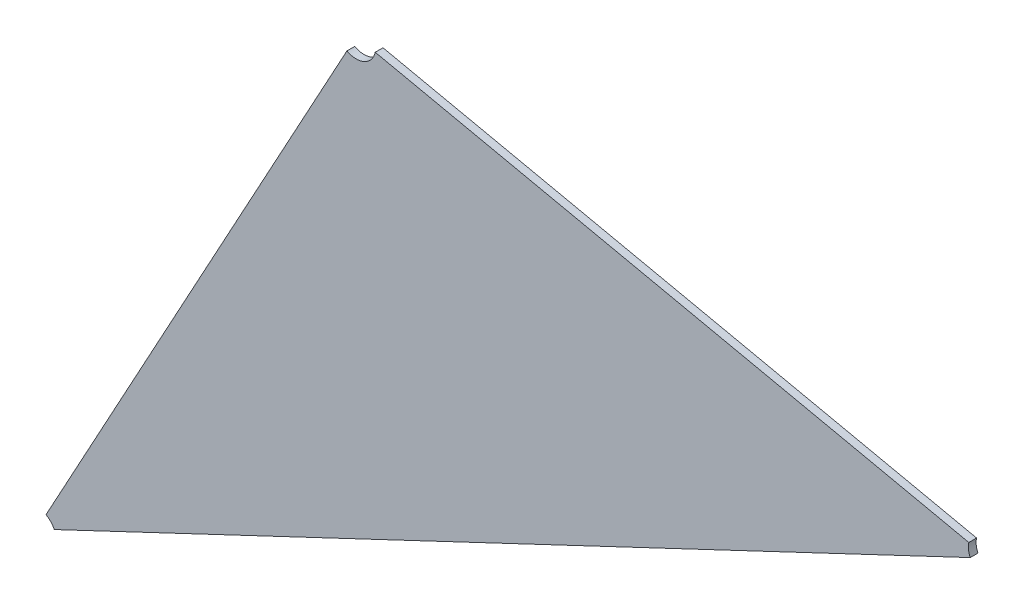
ISO-10303-21;
HEADER;
FILE_DESCRIPTION(('STEP AP214'),'2;1');
FILE_NAME('part.step','',(''),(''),'','','');
FILE_SCHEMA(('AUTOMOTIVE_DESIGN { 1 0 10303 214 1 1 1 1 }'));
ENDSEC;
DATA;
#1=APPLICATION_CONTEXT('core data for automotive mechanical design processes');
#2=APPLICATION_PROTOCOL_DEFINITION('international standard','automotive_design',2000,#1);
#3=PRODUCT_CONTEXT('',#1,'mechanical');
#4=PRODUCT('Part','Part','',(#3));
#5=PRODUCT_RELATED_PRODUCT_CATEGORY('part','',(#4));
#6=PRODUCT_DEFINITION_FORMATION('','',#4);
#7=PRODUCT_DEFINITION_CONTEXT('part definition',#1,'design');
#8=PRODUCT_DEFINITION('design','',#6,#7);
#9=PRODUCT_DEFINITION_SHAPE('','',#8);
#10=(LENGTH_UNIT() NAMED_UNIT(*) SI_UNIT(.MILLI.,.METRE.));
#11=(NAMED_UNIT(*) PLANE_ANGLE_UNIT() SI_UNIT($,.RADIAN.));
#12=(NAMED_UNIT(*) SI_UNIT($,.STERADIAN.) SOLID_ANGLE_UNIT());
#13=UNCERTAINTY_MEASURE_WITH_UNIT(LENGTH_MEASURE(1.E-05),#10,'distance_accuracy_value','');
#14=(GEOMETRIC_REPRESENTATION_CONTEXT(3) GLOBAL_UNCERTAINTY_ASSIGNED_CONTEXT((#13)) GLOBAL_UNIT_ASSIGNED_CONTEXT((#10,
#11,#12)) REPRESENTATION_CONTEXT('',''));
#15=CARTESIAN_POINT('',(0.,0.,0.));
#16=DIRECTION('',(0.,0.,1.));
#17=DIRECTION('',(1.,0.,0.));
#18=AXIS2_PLACEMENT_3D('',#15,#16,#17);
#19=CARTESIAN_POINT('',(-1.7016489577392,-1.2265091946304,0.002));
#20=DIRECTION('',(0.,0.,1.));
#21=DIRECTION('',(-1.,0.,0.));
#22=AXIS2_PLACEMENT_3D('',#19,#20,#21);
#23=CYLINDRICAL_SURFACE('',#22,0.00499999999999999);
#24=DIRECTION('',(0.,0.,-1.));
#25=VECTOR('',#24,1.);
#26=CARTESIAN_POINT('',(-1.70404189971311,-1.23089939151773,0.002));
#27=LINE('',#26,#25);
#28=CARTESIAN_POINT('',(-1.70404189971311,-1.23089939151773,0.002));
#29=VERTEX_POINT('',#28);
#30=CARTESIAN_POINT('',(-1.70404189971311,-1.23089939151773,0.));
#31=VERTEX_POINT('',#30);
#32=EDGE_CURVE('E11',#29,#31,#27,.T.);
#33=ORIENTED_EDGE('',*,*,#32,.F.);
#34=CARTESIAN_POINT('',(-1.7016489577392,-1.2265091946304,0.002));
#35=DIRECTION('',(0.,0.,-1.));
#36=DIRECTION('',(0.977619939969186,-0.210378832049818,0.));
#37=AXIS2_PLACEMENT_3D('',#34,#35,#36);
#38=CIRCLE('',#37,0.00499999999999999);
#39=CARTESIAN_POINT('',(-1.69676085803935,-1.22756108879065,0.002));
#40=VERTEX_POINT('',#39);
#41=EDGE_CURVE('E72',#40,#29,#38,.T.);
#42=ORIENTED_EDGE('',*,*,#41,.F.);
#43=DIRECTION('',(-1.11022302462516E-13,0.,1.));
#44=VECTOR('',#43,1.);
#45=CARTESIAN_POINT('',(-1.69676085803935,-1.22756108879065,0.));
#46=LINE('',#45,#44);
#47=CARTESIAN_POINT('',(-1.69676085803935,-1.22756108879065,0.));
#48=VERTEX_POINT('',#47);
#49=EDGE_CURVE('E94',#48,#40,#46,.T.);
#50=ORIENTED_EDGE('',*,*,#49,.F.);
#51=CARTESIAN_POINT('',(-1.7016489577392,-1.2265091946304,0.));
#52=DIRECTION('',(0.,0.,1.));
#53=DIRECTION('',(-0.478588394781764,-0.878039377465621,0.));
#54=AXIS2_PLACEMENT_3D('',#51,#52,#53);
#55=CIRCLE('',#54,0.00499999999999999);
#56=EDGE_CURVE('E109',#31,#48,#55,.T.);
#57=ORIENTED_EDGE('',*,*,#56,.F.);
#58=EDGE_LOOP('',(#33,#42,#50,#57));
#59=FACE_BOUND('',#58,.T.);
#60=ADVANCED_FACE('F17',(#59),#23,.F.);
#61=CARTESIAN_POINT('',(-1.53897591651193,-1.26151560460655,0.002));
#62=DIRECTION('',(0.,0.,1.));
#63=DIRECTION('',(-1.,0.,0.));
#64=AXIS2_PLACEMENT_3D('',#61,#62,#63);
#65=CYLINDRICAL_SURFACE('',#64,0.00500000000000008);
#66=DIRECTION('',(0.,0.,-1.));
#67=VECTOR('',#66,1.);
#68=CARTESIAN_POINT('',(-1.54386401621178,-1.2604637104463,0.002));
#69=LINE('',#68,#67);
#70=CARTESIAN_POINT('',(-1.54386401621178,-1.2604637104463,0.002));
#71=VERTEX_POINT('',#70);
#72=CARTESIAN_POINT('',(-1.54386401621178,-1.2604637104463,0.));
#73=VERTEX_POINT('',#72);
#74=EDGE_CURVE('E24',#71,#73,#69,.T.);
#75=ORIENTED_EDGE('',*,*,#74,.F.);
#76=CARTESIAN_POINT('',(-1.53897591651193,-1.26151560460655,0.002));
#77=DIRECTION('',(0.,0.,-1.));
#78=DIRECTION('',(-0.903806397976228,-0.427941578930159,0.));
#79=AXIS2_PLACEMENT_3D('',#76,#77,#78);
#80=CIRCLE('',#79,0.00500000000000008);
#81=CARTESIAN_POINT('',(-1.54349494850181,-1.2636553125012,0.002));
#82=VERTEX_POINT('',#81);
#83=EDGE_CURVE('E90',#82,#71,#80,.T.);
#84=ORIENTED_EDGE('',*,*,#83,.F.);
#85=DIRECTION('',(0.,0.,1.));
#86=VECTOR('',#85,1.);
#87=CARTESIAN_POINT('',(-1.54349494850181,-1.2636553125012,0.));
#88=LINE('',#87,#86);
#89=CARTESIAN_POINT('',(-1.54349494850181,-1.2636553125012,0.));
#90=VERTEX_POINT('',#89);
#91=EDGE_CURVE('E120',#90,#82,#88,.T.);
#92=ORIENTED_EDGE('',*,*,#91,.F.);
#93=CARTESIAN_POINT('',(-1.53897591651193,-1.26151560460655,0.));
#94=DIRECTION('',(0.,0.,1.));
#95=DIRECTION('',(-0.977619939969195,0.210378832049775,0.));
#96=AXIS2_PLACEMENT_3D('',#93,#94,#95);
#97=CIRCLE('',#96,0.00500000000000008);
#98=EDGE_CURVE('E75',#73,#90,#97,.T.);
#99=ORIENTED_EDGE('',*,*,#98,.F.);
#100=EDGE_LOOP('',(#75,#84,#92,#99));
#101=FACE_BOUND('',#100,.T.);
#102=ADVANCED_FACE('F124',(#101),#65,.F.);
#103=CARTESIAN_POINT('',(-1.78395411602342,-1.37750986813174,0.002));
#104=DIRECTION('',(0.,0.,1.));
#105=DIRECTION('',(-1.,0.,0.));
#106=AXIS2_PLACEMENT_3D('',#103,#104,#105);
#107=CYLINDRICAL_SURFACE('',#106,0.00499999999999997);
#108=DIRECTION('',(0.,0.,1.));
#109=VECTOR('',#108,1.);
#110=CARTESIAN_POINT('',(-1.78156117404951,-1.37311967124442,0.));
#111=LINE('',#110,#109);
#112=CARTESIAN_POINT('',(-1.78156117404951,-1.37311967124442,0.));
#113=VERTEX_POINT('',#112);
#114=CARTESIAN_POINT('',(-1.78156117404951,-1.37311967124442,0.002));
#115=VERTEX_POINT('',#114);
#116=EDGE_CURVE('E79',#113,#115,#111,.T.);
#117=ORIENTED_EDGE('',*,*,#116,.F.);
#118=CARTESIAN_POINT('',(-1.78395411602342,-1.37750986813174,0.));
#119=DIRECTION('',(0.,0.,1.));
#120=DIRECTION('',(0.903806397976253,0.427941578930105,0.));
#121=AXIS2_PLACEMENT_3D('',#118,#119,#120);
#122=CIRCLE('',#121,0.00499999999999997);
#123=CARTESIAN_POINT('',(-1.77943508403354,-1.37537016023709,0.));
#124=VERTEX_POINT('',#123);
#125=EDGE_CURVE('E123',#124,#113,#122,.T.);
#126=ORIENTED_EDGE('',*,*,#125,.F.);
#127=DIRECTION('',(0.,0.,-1.));
#128=VECTOR('',#127,1.);
#129=CARTESIAN_POINT('',(-1.77943508403354,-1.37537016023709,0.002));
#130=LINE('',#129,#128);
#131=CARTESIAN_POINT('',(-1.77943508403354,-1.37537016023709,0.002));
#132=VERTEX_POINT('',#131);
#133=EDGE_CURVE('E82',#132,#124,#130,.T.);
#134=ORIENTED_EDGE('',*,*,#133,.F.);
#135=CARTESIAN_POINT('',(-1.78395411602342,-1.37750986813174,0.002));
#136=DIRECTION('',(0.,0.,-1.));
#137=DIRECTION('',(0.478588394782654,0.878039377465135,0.));
#138=AXIS2_PLACEMENT_3D('',#135,#136,#137);
#139=CIRCLE('',#138,0.00499999999999997);
#140=EDGE_CURVE('E70',#115,#132,#139,.T.);
#141=ORIENTED_EDGE('',*,*,#140,.F.);
#142=EDGE_LOOP('',(#117,#126,#134,#141));
#143=FACE_BOUND('',#142,.T.);
#144=ADVANCED_FACE('F78',(#143),#107,.F.);
#145=CARTESIAN_POINT('',(-1.7016489577392,-1.2265091946304,0.));
#146=DIRECTION('',(-0.210378832050013,-0.977619939969144,0.));
#147=DIRECTION('',(0.977619939969144,-0.210378832050013,0.));
#148=AXIS2_PLACEMENT_3D('',#145,#146,#147);
#149=PLANE('',#148);
#150=ORIENTED_EDGE('',*,*,#49,.T.);
#151=DIRECTION('',(0.977619939969144,-0.210378832050012,0.));
#152=VECTOR('',#151,1.);
#153=CARTESIAN_POINT('',(-1.69676085803935,-1.22756108879065,0.002));
#154=LINE('',#153,#152);
#155=EDGE_CURVE('E104',#40,#71,#154,.T.);
#156=ORIENTED_EDGE('',*,*,#155,.T.);
#157=ORIENTED_EDGE('',*,*,#74,.T.);
#158=DIRECTION('',(0.977619939969144,-0.210378832050012,0.));
#159=VECTOR('',#158,1.);
#160=CARTESIAN_POINT('',(-1.69676085803935,-1.22756108879065,0.));
#161=LINE('',#160,#159);
#162=EDGE_CURVE('E102',#48,#73,#161,.T.);
#163=ORIENTED_EDGE('',*,*,#162,.F.);
#164=EDGE_LOOP('',(#150,#156,#157,#163));
#165=FACE_BOUND('',#164,.T.);
#166=ADVANCED_FACE('F101',(#165),#149,.F.);
#167=CARTESIAN_POINT('',(-1.67318128292145,-1.29395884484365,0.002));
#168=DIRECTION('',(0.,0.,-1.));
#169=DIRECTION('',(-1.,0.,0.));
#170=AXIS2_PLACEMENT_3D('',#167,#168,#169);
#171=PLANE('',#170);
#172=ORIENTED_EDGE('',*,*,#41,.T.);
#173=DIRECTION('',(0.478588394782362,0.878039377465294,0.));
#174=VECTOR('',#173,1.);
#175=CARTESIAN_POINT('',(-1.78156117404951,-1.37311967124442,0.002));
#176=LINE('',#175,#174);
#177=EDGE_CURVE('E66',#115,#29,#176,.T.);
#178=ORIENTED_EDGE('',*,*,#177,.F.);
#179=ORIENTED_EDGE('',*,*,#140,.T.);
#180=DIRECTION('',(-0.903806397975917,-0.427941578930814,0.));
#181=VECTOR('',#180,1.);
#182=CARTESIAN_POINT('',(-1.54349494850181,-1.2636553125012,0.002));
#183=LINE('',#182,#181);
#184=EDGE_CURVE('E84',#82,#132,#183,.T.);
#185=ORIENTED_EDGE('',*,*,#184,.F.);
#186=ORIENTED_EDGE('',*,*,#83,.T.);
#187=ORIENTED_EDGE('',*,*,#155,.F.);
#188=EDGE_LOOP('',(#172,#178,#179,#185,#186,#187));
#189=FACE_BOUND('',#188,.T.);
#190=ADVANCED_FACE('F68',(#189),#171,.F.);
#191=CARTESIAN_POINT('',(-1.53897591651193,-1.26151560460655,0.));
#192=DIRECTION('',(-0.427941578930813,0.903806397975918,0.));
#193=DIRECTION('',(-0.903806397975918,-0.427941578930813,0.));
#194=AXIS2_PLACEMENT_3D('',#191,#192,#193);
#195=PLANE('',#194);
#196=ORIENTED_EDGE('',*,*,#91,.T.);
#197=ORIENTED_EDGE('',*,*,#184,.T.);
#198=ORIENTED_EDGE('',*,*,#133,.T.);
#199=DIRECTION('',(-0.903806397975917,-0.427941578930814,0.));
#200=VECTOR('',#199,1.);
#201=CARTESIAN_POINT('',(-1.54349494850181,-1.2636553125012,0.));
#202=LINE('',#201,#200);
#203=EDGE_CURVE('E112',#90,#124,#202,.T.);
#204=ORIENTED_EDGE('',*,*,#203,.F.);
#205=EDGE_LOOP('',(#196,#197,#198,#204));
#206=FACE_BOUND('',#205,.T.);
#207=ADVANCED_FACE('F127',(#206),#195,.F.);
#208=CARTESIAN_POINT('',(-1.78395411602342,-1.37750986813174,0.));
#209=DIRECTION('',(0.878039377465294,-0.478588394782364,0.));
#210=DIRECTION('',(0.478588394782364,0.878039377465294,0.));
#211=AXIS2_PLACEMENT_3D('',#208,#209,#210);
#212=PLANE('',#211);
#213=ORIENTED_EDGE('',*,*,#32,.T.);
#214=DIRECTION('',(0.478588394782362,0.878039377465294,0.));
#215=VECTOR('',#214,1.);
#216=CARTESIAN_POINT('',(-1.78156117404951,-1.37311967124442,0.));
#217=LINE('',#216,#215);
#218=EDGE_CURVE('E88',#113,#31,#217,.T.);
#219=ORIENTED_EDGE('',*,*,#218,.F.);
#220=ORIENTED_EDGE('',*,*,#116,.T.);
#221=ORIENTED_EDGE('',*,*,#177,.T.);
#222=EDGE_LOOP('',(#213,#219,#220,#221));
#223=FACE_BOUND('',#222,.T.);
#224=ADVANCED_FACE('F86',(#223),#212,.F.);
#225=CARTESIAN_POINT('',(-1.67318128292145,-1.29395884484365,0.));
#226=DIRECTION('',(0.,0.,-1.));
#227=DIRECTION('',(-1.,0.,0.));
#228=AXIS2_PLACEMENT_3D('',#225,#226,#227);
#229=PLANE('',#228);
#230=ORIENTED_EDGE('',*,*,#56,.T.);
#231=ORIENTED_EDGE('',*,*,#162,.T.);
#232=ORIENTED_EDGE('',*,*,#98,.T.);
#233=ORIENTED_EDGE('',*,*,#203,.T.);
#234=ORIENTED_EDGE('',*,*,#125,.T.);
#235=ORIENTED_EDGE('',*,*,#218,.T.);
#236=EDGE_LOOP('',(#230,#231,#232,#233,#234,#235));
#237=FACE_BOUND('',#236,.T.);
#238=ADVANCED_FACE('F107',(#237),#229,.T.);
#239=CLOSED_SHELL('',(#60,#102,#144,#166,#190,#207,#224,#238));
#240=MANIFOLD_SOLID_BREP('B1',#239);
#241=ADVANCED_BREP_SHAPE_REPRESENTATION('',(#18,#240),#14);
#242=SHAPE_DEFINITION_REPRESENTATION(#9,#241);
ENDSEC;
END-ISO-10303-21;
